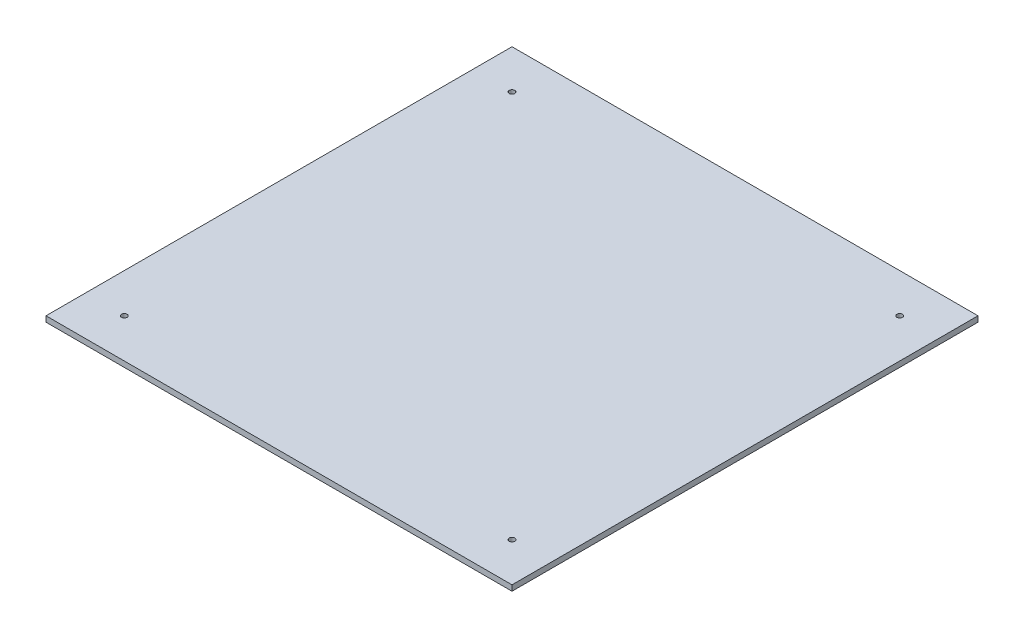
ISO-10303-21;
HEADER;
FILE_DESCRIPTION(('STEP AP214'),'2;1');
FILE_NAME('part.step','',(''),(''),'','','');
FILE_SCHEMA(('AUTOMOTIVE_DESIGN { 1 0 10303 214 1 1 1 1 }'));
ENDSEC;
DATA;
#1=APPLICATION_CONTEXT('core data for automotive mechanical design processes');
#2=APPLICATION_PROTOCOL_DEFINITION('international standard','automotive_design',2000,#1);
#3=PRODUCT_CONTEXT('',#1,'mechanical');
#4=PRODUCT('Part','Part','',(#3));
#5=PRODUCT_RELATED_PRODUCT_CATEGORY('part','',(#4));
#6=PRODUCT_DEFINITION_FORMATION('','',#4);
#7=PRODUCT_DEFINITION_CONTEXT('part definition',#1,'design');
#8=PRODUCT_DEFINITION('design','',#6,#7);
#9=PRODUCT_DEFINITION_SHAPE('','',#8);
#10=(LENGTH_UNIT() NAMED_UNIT(*) SI_UNIT(.MILLI.,.METRE.));
#11=(NAMED_UNIT(*) PLANE_ANGLE_UNIT() SI_UNIT($,.RADIAN.));
#12=(NAMED_UNIT(*) SI_UNIT($,.STERADIAN.) SOLID_ANGLE_UNIT());
#13=UNCERTAINTY_MEASURE_WITH_UNIT(LENGTH_MEASURE(1.E-05),#10,'distance_accuracy_value','');
#14=(GEOMETRIC_REPRESENTATION_CONTEXT(3) GLOBAL_UNCERTAINTY_ASSIGNED_CONTEXT((#13)) GLOBAL_UNIT_ASSIGNED_CONTEXT((#10,
#11,#12)) REPRESENTATION_CONTEXT('',''));
#15=CARTESIAN_POINT('',(0.,0.,0.));
#16=DIRECTION('',(0.,0.,1.));
#17=DIRECTION('',(1.,0.,0.));
#18=AXIS2_PLACEMENT_3D('',#15,#16,#17);
#19=CARTESIAN_POINT('',(0.,3.,0.));
#20=DIRECTION('',(0.,-1.,0.));
#21=DIRECTION('',(0.,0.,-1.));
#22=AXIS2_PLACEMENT_3D('',#19,#20,#21);
#23=PLANE('',#22);
#24=DIRECTION('',(0.,0.,-1.));
#25=VECTOR('',#24,1.);
#26=CARTESIAN_POINT('',(125.,3.,125.));
#27=LINE('',#26,#25);
#28=CARTESIAN_POINT('',(125.,3.,125.));
#29=VERTEX_POINT('',#28);
#30=CARTESIAN_POINT('',(125.,3.,-125.));
#31=VERTEX_POINT('',#30);
#32=EDGE_CURVE('E84',#29,#31,#27,.T.);
#33=ORIENTED_EDGE('',*,*,#32,.T.);
#34=DIRECTION('',(-1.,0.,0.));
#35=VECTOR('',#34,1.);
#36=CARTESIAN_POINT('',(-125.,3.,-125.));
#37=LINE('',#36,#35);
#38=CARTESIAN_POINT('',(-125.,3.,-125.));
#39=VERTEX_POINT('',#38);
#40=EDGE_CURVE('E79',#31,#39,#37,.T.);
#41=ORIENTED_EDGE('',*,*,#40,.T.);
#42=DIRECTION('',(0.,0.,1.));
#43=VECTOR('',#42,1.);
#44=CARTESIAN_POINT('',(-125.,3.,125.));
#45=LINE('',#44,#43);
#46=CARTESIAN_POINT('',(-125.,3.,125.));
#47=VERTEX_POINT('',#46);
#48=EDGE_CURVE('E82',#39,#47,#45,.T.);
#49=ORIENTED_EDGE('',*,*,#48,.T.);
#50=DIRECTION('',(1.,0.,0.));
#51=VECTOR('',#50,1.);
#52=CARTESIAN_POINT('',(-125.,3.,125.));
#53=LINE('',#52,#51);
#54=EDGE_CURVE('E49',#47,#29,#53,.T.);
#55=ORIENTED_EDGE('',*,*,#54,.T.);
#56=EDGE_LOOP('',(#33,#41,#49,#55));
#57=FACE_BOUND('',#56,.T.);
#58=CARTESIAN_POINT('',(-104.,3.,-104.));
#59=DIRECTION('',(0.,1.,0.));
#60=DIRECTION('',(0.,0.,1.));
#61=AXIS2_PLACEMENT_3D('',#58,#59,#60);
#62=CIRCLE('',#61,1.5);
#63=CARTESIAN_POINT('',(-104.,3.,-102.5));
#64=VERTEX_POINT('',#63);
#65=EDGE_CURVE('E99',#64,#64,#62,.T.);
#66=ORIENTED_EDGE('',*,*,#65,.F.);
#67=EDGE_LOOP('',(#66));
#68=FACE_BOUND('',#67,.T.);
#69=CARTESIAN_POINT('',(-104.,3.,104.));
#70=DIRECTION('',(0.,1.,0.));
#71=DIRECTION('',(0.,0.,1.));
#72=AXIS2_PLACEMENT_3D('',#69,#70,#71);
#73=CIRCLE('',#72,1.5);
#74=CARTESIAN_POINT('',(-104.,3.,105.5));
#75=VERTEX_POINT('',#74);
#76=EDGE_CURVE('E114',#75,#75,#73,.T.);
#77=ORIENTED_EDGE('',*,*,#76,.F.);
#78=EDGE_LOOP('',(#77));
#79=FACE_BOUND('',#78,.T.);
#80=CARTESIAN_POINT('',(104.,3.,104.));
#81=DIRECTION('',(0.,1.,0.));
#82=DIRECTION('',(0.,0.,-1.));
#83=AXIS2_PLACEMENT_3D('',#80,#81,#82);
#84=CIRCLE('',#83,1.5);
#85=CARTESIAN_POINT('',(104.,3.,102.5));
#86=VERTEX_POINT('',#85);
#87=EDGE_CURVE('E120',#86,#86,#84,.T.);
#88=ORIENTED_EDGE('',*,*,#87,.F.);
#89=EDGE_LOOP('',(#88));
#90=FACE_BOUND('',#89,.T.);
#91=CARTESIAN_POINT('',(104.,3.,-104.));
#92=DIRECTION('',(0.,1.,0.));
#93=DIRECTION('',(0.,0.,-1.));
#94=AXIS2_PLACEMENT_3D('',#91,#92,#93);
#95=CIRCLE('',#94,1.5);
#96=CARTESIAN_POINT('',(104.,3.,-105.5));
#97=VERTEX_POINT('',#96);
#98=EDGE_CURVE('E126',#97,#97,#95,.T.);
#99=ORIENTED_EDGE('',*,*,#98,.F.);
#100=EDGE_LOOP('',(#99));
#101=FACE_BOUND('',#100,.T.);
#102=ADVANCED_FACE('F32',(#57,#68,#79,#90,#101),#23,.F.);
#103=CARTESIAN_POINT('',(0.,0.,0.));
#104=DIRECTION('',(0.,-1.,0.));
#105=DIRECTION('',(0.,0.,-1.));
#106=AXIS2_PLACEMENT_3D('',#103,#104,#105);
#107=PLANE('',#106);
#108=CARTESIAN_POINT('',(104.,0.,104.));
#109=DIRECTION('',(0.,1.,0.));
#110=DIRECTION('',(0.,0.,-1.));
#111=AXIS2_PLACEMENT_3D('',#108,#109,#110);
#112=CIRCLE('',#111,1.5);
#113=CARTESIAN_POINT('',(104.,0.,102.5));
#114=VERTEX_POINT('',#113);
#115=EDGE_CURVE('E123',#114,#114,#112,.T.);
#116=ORIENTED_EDGE('',*,*,#115,.T.);
#117=EDGE_LOOP('',(#116));
#118=FACE_BOUND('',#117,.T.);
#119=CARTESIAN_POINT('',(-104.,0.,-104.));
#120=DIRECTION('',(0.,1.,0.));
#121=DIRECTION('',(0.,0.,1.));
#122=AXIS2_PLACEMENT_3D('',#119,#120,#121);
#123=CIRCLE('',#122,1.5);
#124=CARTESIAN_POINT('',(-104.,0.,-102.5));
#125=VERTEX_POINT('',#124);
#126=EDGE_CURVE('E111',#125,#125,#123,.T.);
#127=ORIENTED_EDGE('',*,*,#126,.T.);
#128=EDGE_LOOP('',(#127));
#129=FACE_BOUND('',#128,.T.);
#130=DIRECTION('',(0.,0.,-1.));
#131=VECTOR('',#130,1.);
#132=CARTESIAN_POINT('',(125.,0.,125.));
#133=LINE('',#132,#131);
#134=CARTESIAN_POINT('',(125.,0.,125.));
#135=VERTEX_POINT('',#134);
#136=CARTESIAN_POINT('',(125.,0.,-125.));
#137=VERTEX_POINT('',#136);
#138=EDGE_CURVE('E96',#135,#137,#133,.T.);
#139=ORIENTED_EDGE('',*,*,#138,.F.);
#140=DIRECTION('',(1.,0.,0.));
#141=VECTOR('',#140,1.);
#142=CARTESIAN_POINT('',(-125.,0.,125.));
#143=LINE('',#142,#141);
#144=CARTESIAN_POINT('',(-125.,0.,125.));
#145=VERTEX_POINT('',#144);
#146=EDGE_CURVE('E72',#145,#135,#143,.T.);
#147=ORIENTED_EDGE('',*,*,#146,.F.);
#148=DIRECTION('',(0.,0.,1.));
#149=VECTOR('',#148,1.);
#150=CARTESIAN_POINT('',(-125.,0.,125.));
#151=LINE('',#150,#149);
#152=CARTESIAN_POINT('',(-125.,0.,-125.));
#153=VERTEX_POINT('',#152);
#154=EDGE_CURVE('E66',#153,#145,#151,.T.);
#155=ORIENTED_EDGE('',*,*,#154,.F.);
#156=DIRECTION('',(-1.,0.,0.));
#157=VECTOR('',#156,1.);
#158=CARTESIAN_POINT('',(-125.,0.,-125.));
#159=LINE('',#158,#157);
#160=EDGE_CURVE('E88',#137,#153,#159,.T.);
#161=ORIENTED_EDGE('',*,*,#160,.F.);
#162=EDGE_LOOP('',(#139,#147,#155,#161));
#163=FACE_BOUND('',#162,.T.);
#164=CARTESIAN_POINT('',(-104.,0.,104.));
#165=DIRECTION('',(0.,1.,0.));
#166=DIRECTION('',(0.,0.,1.));
#167=AXIS2_PLACEMENT_3D('',#164,#165,#166);
#168=CIRCLE('',#167,1.5);
#169=CARTESIAN_POINT('',(-104.,0.,105.5));
#170=VERTEX_POINT('',#169);
#171=EDGE_CURVE('E117',#170,#170,#168,.T.);
#172=ORIENTED_EDGE('',*,*,#171,.T.);
#173=EDGE_LOOP('',(#172));
#174=FACE_BOUND('',#173,.T.);
#175=CARTESIAN_POINT('',(104.,0.,-104.));
#176=DIRECTION('',(0.,1.,0.));
#177=DIRECTION('',(0.,0.,-1.));
#178=AXIS2_PLACEMENT_3D('',#175,#176,#177);
#179=CIRCLE('',#178,1.5);
#180=CARTESIAN_POINT('',(104.,0.,-105.5));
#181=VERTEX_POINT('',#180);
#182=EDGE_CURVE('E129',#181,#181,#179,.T.);
#183=ORIENTED_EDGE('',*,*,#182,.T.);
#184=EDGE_LOOP('',(#183));
#185=FACE_BOUND('',#184,.T.);
#186=ADVANCED_FACE('F107',(#118,#129,#163,#174,#185),#107,.T.);
#187=CARTESIAN_POINT('',(125.,3.,125.));
#188=DIRECTION('',(-1.,0.,0.));
#189=DIRECTION('',(0.,0.,1.));
#190=AXIS2_PLACEMENT_3D('',#187,#188,#189);
#191=PLANE('',#190);
#192=ORIENTED_EDGE('',*,*,#138,.T.);
#193=DIRECTION('',(0.,-1.,0.));
#194=VECTOR('',#193,1.);
#195=CARTESIAN_POINT('',(125.,3.,-125.));
#196=LINE('',#195,#194);
#197=EDGE_CURVE('E11',#31,#137,#196,.T.);
#198=ORIENTED_EDGE('',*,*,#197,.F.);
#199=ORIENTED_EDGE('',*,*,#32,.F.);
#200=DIRECTION('',(0.,-1.,0.));
#201=VECTOR('',#200,1.);
#202=CARTESIAN_POINT('',(125.,3.,125.));
#203=LINE('',#202,#201);
#204=EDGE_CURVE('E92',#29,#135,#203,.T.);
#205=ORIENTED_EDGE('',*,*,#204,.T.);
#206=EDGE_LOOP('',(#192,#198,#199,#205));
#207=FACE_BOUND('',#206,.T.);
#208=ADVANCED_FACE('F34',(#207),#191,.F.);
#209=CARTESIAN_POINT('',(-125.,3.,-125.));
#210=DIRECTION('',(0.,0.,1.));
#211=DIRECTION('',(1.,0.,0.));
#212=AXIS2_PLACEMENT_3D('',#209,#210,#211);
#213=PLANE('',#212);
#214=ORIENTED_EDGE('',*,*,#160,.T.);
#215=DIRECTION('',(0.,-1.,0.));
#216=VECTOR('',#215,1.);
#217=CARTESIAN_POINT('',(-125.,3.,-125.));
#218=LINE('',#217,#216);
#219=EDGE_CURVE('E41',#39,#153,#218,.T.);
#220=ORIENTED_EDGE('',*,*,#219,.F.);
#221=ORIENTED_EDGE('',*,*,#40,.F.);
#222=ORIENTED_EDGE('',*,*,#197,.T.);
#223=EDGE_LOOP('',(#214,#220,#221,#222));
#224=FACE_BOUND('',#223,.T.);
#225=ADVANCED_FACE('F87',(#224),#213,.F.);
#226=CARTESIAN_POINT('',(-125.,3.,125.));
#227=DIRECTION('',(1.,0.,0.));
#228=DIRECTION('',(0.,0.,-1.));
#229=AXIS2_PLACEMENT_3D('',#226,#227,#228);
#230=PLANE('',#229);
#231=ORIENTED_EDGE('',*,*,#154,.T.);
#232=DIRECTION('',(0.,-1.,0.));
#233=VECTOR('',#232,1.);
#234=CARTESIAN_POINT('',(-125.,3.,125.));
#235=LINE('',#234,#233);
#236=EDGE_CURVE('E89',#47,#145,#235,.T.);
#237=ORIENTED_EDGE('',*,*,#236,.F.);
#238=ORIENTED_EDGE('',*,*,#48,.F.);
#239=ORIENTED_EDGE('',*,*,#219,.T.);
#240=EDGE_LOOP('',(#231,#237,#238,#239));
#241=FACE_BOUND('',#240,.T.);
#242=ADVANCED_FACE('F90',(#241),#230,.F.);
#243=CARTESIAN_POINT('',(-125.,3.,125.));
#244=DIRECTION('',(0.,0.,-1.));
#245=DIRECTION('',(-1.,0.,0.));
#246=AXIS2_PLACEMENT_3D('',#243,#244,#245);
#247=PLANE('',#246);
#248=ORIENTED_EDGE('',*,*,#146,.T.);
#249=ORIENTED_EDGE('',*,*,#204,.F.);
#250=ORIENTED_EDGE('',*,*,#54,.F.);
#251=ORIENTED_EDGE('',*,*,#236,.T.);
#252=EDGE_LOOP('',(#248,#249,#250,#251));
#253=FACE_BOUND('',#252,.T.);
#254=ADVANCED_FACE('F104',(#253),#247,.F.);
#255=CARTESIAN_POINT('',(-104.,3.,-104.));
#256=DIRECTION('',(0.,-1.,0.));
#257=DIRECTION('',(0.,0.,-1.));
#258=AXIS2_PLACEMENT_3D('',#255,#256,#257);
#259=CYLINDRICAL_SURFACE('',#258,1.5);
#260=ORIENTED_EDGE('',*,*,#65,.T.);
#261=EDGE_LOOP('',(#260));
#262=FACE_BOUND('',#261,.T.);
#263=ORIENTED_EDGE('',*,*,#126,.F.);
#264=EDGE_LOOP('',(#263));
#265=FACE_BOUND('',#264,.T.);
#266=ADVANCED_FACE('F146',(#262,#265),#259,.F.);
#267=CARTESIAN_POINT('',(-104.,3.,104.));
#268=DIRECTION('',(0.,-1.,0.));
#269=DIRECTION('',(0.,0.,-1.));
#270=AXIS2_PLACEMENT_3D('',#267,#268,#269);
#271=CYLINDRICAL_SURFACE('',#270,1.5);
#272=ORIENTED_EDGE('',*,*,#76,.T.);
#273=EDGE_LOOP('',(#272));
#274=FACE_BOUND('',#273,.T.);
#275=ORIENTED_EDGE('',*,*,#171,.F.);
#276=EDGE_LOOP('',(#275));
#277=FACE_BOUND('',#276,.T.);
#278=ADVANCED_FACE('F192',(#274,#277),#271,.F.);
#279=CARTESIAN_POINT('',(104.,3.,104.));
#280=DIRECTION('',(0.,-1.,0.));
#281=DIRECTION('',(0.,0.,-1.));
#282=AXIS2_PLACEMENT_3D('',#279,#280,#281);
#283=CYLINDRICAL_SURFACE('',#282,1.5);
#284=ORIENTED_EDGE('',*,*,#87,.T.);
#285=EDGE_LOOP('',(#284));
#286=FACE_BOUND('',#285,.T.);
#287=ORIENTED_EDGE('',*,*,#115,.F.);
#288=EDGE_LOOP('',(#287));
#289=FACE_BOUND('',#288,.T.);
#290=ADVANCED_FACE('F200',(#286,#289),#283,.F.);
#291=CARTESIAN_POINT('',(104.,3.,-104.));
#292=DIRECTION('',(0.,-1.,0.));
#293=DIRECTION('',(0.,0.,-1.));
#294=AXIS2_PLACEMENT_3D('',#291,#292,#293);
#295=CYLINDRICAL_SURFACE('',#294,1.5);
#296=ORIENTED_EDGE('',*,*,#98,.T.);
#297=EDGE_LOOP('',(#296));
#298=FACE_BOUND('',#297,.T.);
#299=ORIENTED_EDGE('',*,*,#182,.F.);
#300=EDGE_LOOP('',(#299));
#301=FACE_BOUND('',#300,.T.);
#302=ADVANCED_FACE('F135',(#298,#301),#295,.F.);
#303=CLOSED_SHELL('',(#102,#186,#208,#225,#242,#254,#266,#278,#290,#302));
#304=MANIFOLD_SOLID_BREP('B2',#303);
#305=ADVANCED_BREP_SHAPE_REPRESENTATION('',(#18,#304),#14);
#306=SHAPE_DEFINITION_REPRESENTATION(#9,#305);
ENDSEC;
END-ISO-10303-21;
